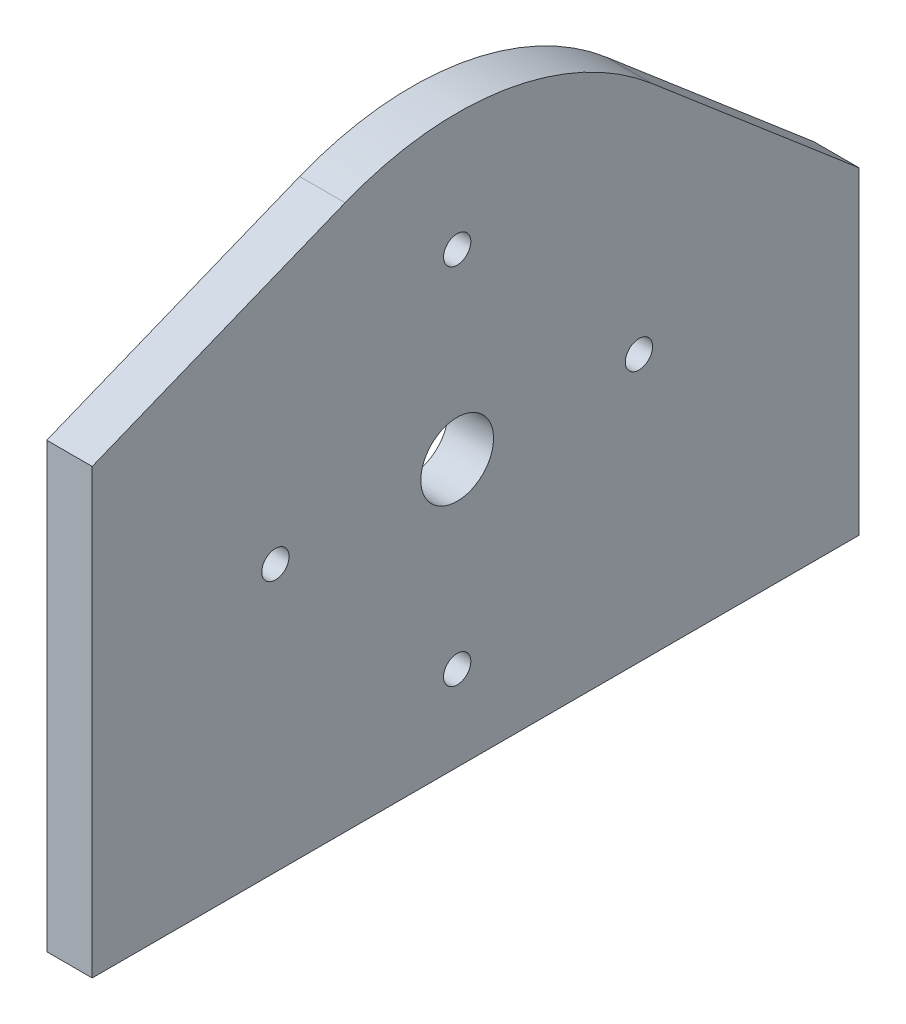
ISO-10303-21;
HEADER;
FILE_DESCRIPTION(('STEP AP214'),'2;1');
FILE_NAME('part.step','',(''),(''),'','','');
FILE_SCHEMA(('AUTOMOTIVE_DESIGN { 1 0 10303 214 1 1 1 1 }'));
ENDSEC;
DATA;
#1=APPLICATION_CONTEXT('core data for automotive mechanical design processes');
#2=APPLICATION_PROTOCOL_DEFINITION('international standard','automotive_design',2000,#1);
#3=PRODUCT_CONTEXT('',#1,'mechanical');
#4=PRODUCT('Part','Part','',(#3));
#5=PRODUCT_RELATED_PRODUCT_CATEGORY('part','',(#4));
#6=PRODUCT_DEFINITION_FORMATION('','',#4);
#7=PRODUCT_DEFINITION_CONTEXT('part definition',#1,'design');
#8=PRODUCT_DEFINITION('design','',#6,#7);
#9=PRODUCT_DEFINITION_SHAPE('','',#8);
#10=(LENGTH_UNIT() NAMED_UNIT(*) SI_UNIT(.MILLI.,.METRE.));
#11=(NAMED_UNIT(*) PLANE_ANGLE_UNIT() SI_UNIT($,.RADIAN.));
#12=(NAMED_UNIT(*) SI_UNIT($,.STERADIAN.) SOLID_ANGLE_UNIT());
#13=UNCERTAINTY_MEASURE_WITH_UNIT(LENGTH_MEASURE(1.E-05),#10,'distance_accuracy_value','');
#14=(GEOMETRIC_REPRESENTATION_CONTEXT(3) GLOBAL_UNCERTAINTY_ASSIGNED_CONTEXT((#13)) GLOBAL_UNIT_ASSIGNED_CONTEXT((#10,
#11,#12)) REPRESENTATION_CONTEXT('',''));
#15=CARTESIAN_POINT('',(0.,0.,0.));
#16=DIRECTION('',(0.,0.,1.));
#17=DIRECTION('',(1.,0.,0.));
#18=AXIS2_PLACEMENT_3D('',#15,#16,#17);
#19=CARTESIAN_POINT('',(5.,81.,0.));
#20=DIRECTION('',(-1.,0.,0.));
#21=DIRECTION('',(0.,0.,-1.));
#22=AXIS2_PLACEMENT_3D('',#19,#20,#21);
#23=CYLINDRICAL_SURFACE('',#22,33.);
#24=CARTESIAN_POINT('',(0.,81.,0.));
#25=DIRECTION('',(-1.,0.,0.));
#26=DIRECTION('',(0.,0.,1.));
#27=AXIS2_PLACEMENT_3D('',#24,#25,#26);
#28=CIRCLE('',#27,33.);
#29=CARTESIAN_POINT('',(0.,111.608123513055,12.3346169380967));
#30=VERTEX_POINT('',#29);
#31=CARTESIAN_POINT('',(0.,106.111358555441,-21.4107372946394));
#32=VERTEX_POINT('',#31);
#33=EDGE_CURVE('E122',#30,#32,#28,.T.);
#34=ORIENTED_EDGE('',*,*,#33,.F.);
#35=DIRECTION('',(-1.,0.,0.));
#36=VECTOR('',#35,1.);
#37=CARTESIAN_POINT('',(5.,111.608123513055,12.3346169380967));
#38=LINE('',#37,#36);
#39=CARTESIAN_POINT('',(5.,111.608123513055,12.3346169380967));
#40=VERTEX_POINT('',#39);
#41=EDGE_CURVE('E121',#40,#30,#38,.T.);
#42=ORIENTED_EDGE('',*,*,#41,.F.);
#43=CARTESIAN_POINT('',(5.,81.,0.));
#44=DIRECTION('',(-1.,0.,0.));
#45=DIRECTION('',(0.,0.,1.));
#46=AXIS2_PLACEMENT_3D('',#43,#44,#45);
#47=CIRCLE('',#46,33.);
#48=CARTESIAN_POINT('',(5.,106.111358555441,-21.4107372946394));
#49=VERTEX_POINT('',#48);
#50=EDGE_CURVE('E135',#40,#49,#47,.T.);
#51=ORIENTED_EDGE('',*,*,#50,.T.);
#52=DIRECTION('',(-1.,0.,0.));
#53=VECTOR('',#52,1.);
#54=CARTESIAN_POINT('',(5.,106.111358555441,-21.4107372946394));
#55=LINE('',#54,#53);
#56=EDGE_CURVE('E11',#49,#32,#55,.T.);
#57=ORIENTED_EDGE('',*,*,#56,.T.);
#58=EDGE_LOOP('',(#34,#42,#51,#57));
#59=FACE_BOUND('',#58,.T.);
#60=ADVANCED_FACE('F39',(#59),#23,.T.);
#61=CARTESIAN_POINT('',(5.,86.6470519239509,-44.2392450723134));
#62=DIRECTION('',(0.,-0.760950259255798,0.64881022104968));
#63=DIRECTION('',(0.,0.64881022104968,0.760950259255798));
#64=AXIS2_PLACEMENT_3D('',#61,#62,#63);
#65=PLANE('',#64);
#66=DIRECTION('',(0.,-0.64881022104968,-0.760950259255798));
#67=VECTOR('',#66,1.);
#68=CARTESIAN_POINT('',(0.,86.6470519239509,-44.2392450723134));
#69=LINE('',#68,#67);
#70=CARTESIAN_POINT('',(0.,86.6470519239509,-44.2392450723134));
#71=VERTEX_POINT('',#70);
#72=EDGE_CURVE('E124',#32,#71,#69,.T.);
#73=ORIENTED_EDGE('',*,*,#72,.F.);
#74=ORIENTED_EDGE('',*,*,#56,.F.);
#75=DIRECTION('',(0.,-0.64881022104968,-0.760950259255798));
#76=VECTOR('',#75,1.);
#77=CARTESIAN_POINT('',(5.,86.6470519239509,-44.2392450723134));
#78=LINE('',#77,#76);
#79=CARTESIAN_POINT('',(5.,86.6470519239509,-44.2392450723134));
#80=VERTEX_POINT('',#79);
#81=EDGE_CURVE('E87',#49,#80,#78,.T.);
#82=ORIENTED_EDGE('',*,*,#81,.T.);
#83=DIRECTION('',(-1.,0.,0.));
#84=VECTOR('',#83,1.);
#85=CARTESIAN_POINT('',(5.,86.6470519239509,-44.2392450723134));
#86=LINE('',#85,#84);
#87=EDGE_CURVE('E47',#80,#71,#86,.T.);
#88=ORIENTED_EDGE('',*,*,#87,.T.);
#89=EDGE_LOOP('',(#73,#74,#82,#88));
#90=FACE_BOUND('',#89,.T.);
#91=ADVANCED_FACE('F141',(#90),#65,.F.);
#92=CARTESIAN_POINT('',(5.,86.6470519239509,-44.2392450723134));
#93=DIRECTION('',(0.,0.,1.));
#94=DIRECTION('',(0.,1.,0.));
#95=AXIS2_PLACEMENT_3D('',#92,#93,#94);
#96=PLANE('',#95);
#97=DIRECTION('',(0.,-1.,0.));
#98=VECTOR('',#97,1.);
#99=CARTESIAN_POINT('',(0.,86.6470519239509,-44.2392450723134));
#100=LINE('',#99,#98);
#101=CARTESIAN_POINT('',(0.,51.6470519239509,-44.2392450723133));
#102=VERTEX_POINT('',#101);
#103=EDGE_CURVE('E128',#71,#102,#100,.T.);
#104=ORIENTED_EDGE('',*,*,#103,.F.);
#105=ORIENTED_EDGE('',*,*,#87,.F.);
#106=DIRECTION('',(0.,-1.,0.));
#107=VECTOR('',#106,1.);
#108=CARTESIAN_POINT('',(5.,86.6470519239509,-44.2392450723134));
#109=LINE('',#108,#107);
#110=CARTESIAN_POINT('',(5.,51.6470519239509,-44.2392450723133));
#111=VERTEX_POINT('',#110);
#112=EDGE_CURVE('E115',#80,#111,#109,.T.);
#113=ORIENTED_EDGE('',*,*,#112,.T.);
#114=DIRECTION('',(-1.,0.,0.));
#115=VECTOR('',#114,1.);
#116=CARTESIAN_POINT('',(5.,51.6470519239509,-44.2392450723133));
#117=LINE('',#116,#115);
#118=EDGE_CURVE('E109',#111,#102,#117,.T.);
#119=ORIENTED_EDGE('',*,*,#118,.T.);
#120=EDGE_LOOP('',(#104,#105,#113,#119));
#121=FACE_BOUND('',#120,.T.);
#122=ADVANCED_FACE('F217',(#121),#96,.F.);
#123=CARTESIAN_POINT('',(5.,51.6470519239509,-44.2392450723133));
#124=DIRECTION('',(0.,1.,0.));
#125=DIRECTION('',(0.,0.,-1.));
#126=AXIS2_PLACEMENT_3D('',#123,#124,#125);
#127=PLANE('',#126);
#128=DIRECTION('',(0.,0.,1.));
#129=VECTOR('',#128,1.);
#130=CARTESIAN_POINT('',(0.,51.6470519239509,-44.2392450723133));
#131=LINE('',#130,#129);
#132=CARTESIAN_POINT('',(0.,51.6470519239509,40.1601837681465));
#133=VERTEX_POINT('',#132);
#134=EDGE_CURVE('E131',#102,#133,#131,.T.);
#135=ORIENTED_EDGE('',*,*,#134,.F.);
#136=ORIENTED_EDGE('',*,*,#118,.F.);
#137=DIRECTION('',(0.,0.,1.));
#138=VECTOR('',#137,1.);
#139=CARTESIAN_POINT('',(5.,51.6470519239509,-44.2392450723133));
#140=LINE('',#139,#138);
#141=CARTESIAN_POINT('',(5.,51.6470519239509,40.1601837681465));
#142=VERTEX_POINT('',#141);
#143=EDGE_CURVE('E99',#111,#142,#140,.T.);
#144=ORIENTED_EDGE('',*,*,#143,.T.);
#145=DIRECTION('',(-1.,0.,0.));
#146=VECTOR('',#145,1.);
#147=CARTESIAN_POINT('',(5.,51.6470519239509,40.1601837681465));
#148=LINE('',#147,#146);
#149=EDGE_CURVE('E104',#142,#133,#148,.T.);
#150=ORIENTED_EDGE('',*,*,#149,.T.);
#151=EDGE_LOOP('',(#135,#136,#144,#150));
#152=FACE_BOUND('',#151,.T.);
#153=ADVANCED_FACE('F112',(#152),#127,.F.);
#154=CARTESIAN_POINT('',(5.,51.6470519239509,40.1601837681465));
#155=DIRECTION('',(0.,0.,-1.));
#156=DIRECTION('',(0.,-1.,0.));
#157=AXIS2_PLACEMENT_3D('',#154,#155,#156);
#158=PLANE('',#157);
#159=DIRECTION('',(0.,1.,0.));
#160=VECTOR('',#159,1.);
#161=CARTESIAN_POINT('',(0.,51.6470519239509,40.1601837681465));
#162=LINE('',#161,#160);
#163=CARTESIAN_POINT('',(0.,100.394835387512,40.1601837681464));
#164=VERTEX_POINT('',#163);
#165=EDGE_CURVE('E106',#133,#164,#162,.T.);
#166=ORIENTED_EDGE('',*,*,#165,.F.);
#167=ORIENTED_EDGE('',*,*,#149,.F.);
#168=DIRECTION('',(0.,1.,0.));
#169=VECTOR('',#168,1.);
#170=CARTESIAN_POINT('',(5.,51.6470519239509,40.1601837681465));
#171=LINE('',#170,#169);
#172=CARTESIAN_POINT('',(5.,100.394835387512,40.1601837681464));
#173=VERTEX_POINT('',#172);
#174=EDGE_CURVE('E95',#142,#173,#171,.T.);
#175=ORIENTED_EDGE('',*,*,#174,.T.);
#176=DIRECTION('',(-1.,0.,0.));
#177=VECTOR('',#176,1.);
#178=CARTESIAN_POINT('',(5.,100.394835387512,40.1601837681464));
#179=LINE('',#178,#177);
#180=EDGE_CURVE('E110',#173,#164,#179,.T.);
#181=ORIENTED_EDGE('',*,*,#180,.T.);
#182=EDGE_LOOP('',(#166,#167,#175,#181));
#183=FACE_BOUND('',#182,.T.);
#184=ADVANCED_FACE('F105',(#183),#158,.F.);
#185=CARTESIAN_POINT('',(5.,100.394835387512,40.1601837681464));
#186=DIRECTION('',(0.,-0.927518894334992,-0.37377627085142));
#187=DIRECTION('',(0.,-0.37377627085142,0.927518894334992));
#188=AXIS2_PLACEMENT_3D('',#185,#186,#187);
#189=PLANE('',#188);
#190=DIRECTION('',(0.,0.37377627085142,-0.927518894334992));
#191=VECTOR('',#190,1.);
#192=CARTESIAN_POINT('',(0.,100.394835387512,40.1601837681464));
#193=LINE('',#192,#191);
#194=EDGE_CURVE('E75',#164,#30,#193,.T.);
#195=ORIENTED_EDGE('',*,*,#194,.F.);
#196=ORIENTED_EDGE('',*,*,#180,.F.);
#197=DIRECTION('',(0.,0.37377627085142,-0.927518894334992));
#198=VECTOR('',#197,1.);
#199=CARTESIAN_POINT('',(5.,100.394835387512,40.1601837681464));
#200=LINE('',#199,#198);
#201=EDGE_CURVE('E55',#173,#40,#200,.T.);
#202=ORIENTED_EDGE('',*,*,#201,.T.);
#203=ORIENTED_EDGE('',*,*,#41,.T.);
#204=EDGE_LOOP('',(#195,#196,#202,#203));
#205=FACE_BOUND('',#204,.T.);
#206=ADVANCED_FACE('F227',(#205),#189,.F.);
#207=CARTESIAN_POINT('',(5.,81.,0.));
#208=DIRECTION('',(1.,0.,0.));
#209=DIRECTION('',(0.,0.,1.));
#210=AXIS2_PLACEMENT_3D('',#207,#208,#209);
#211=PLANE('',#210);
#212=CARTESIAN_POINT('',(5.,81.,0.));
#213=DIRECTION('',(-1.,0.,0.));
#214=DIRECTION('',(0.,0.,1.));
#215=AXIS2_PLACEMENT_3D('',#212,#213,#214);
#216=CIRCLE('',#215,4.);
#217=CARTESIAN_POINT('',(5.,81.,4.));
#218=VERTEX_POINT('',#217);
#219=EDGE_CURVE('E171',#218,#218,#216,.T.);
#220=ORIENTED_EDGE('',*,*,#219,.T.);
#221=EDGE_LOOP('',(#220));
#222=FACE_BOUND('',#221,.T.);
#223=CARTESIAN_POINT('',(5.,81.,-20.));
#224=DIRECTION('',(-1.,0.,0.));
#225=DIRECTION('',(0.,0.,1.));
#226=AXIS2_PLACEMENT_3D('',#223,#224,#225);
#227=CIRCLE('',#226,1.5);
#228=CARTESIAN_POINT('',(5.,81.,-18.5));
#229=VERTEX_POINT('',#228);
#230=EDGE_CURVE('E165',#229,#229,#227,.T.);
#231=ORIENTED_EDGE('',*,*,#230,.T.);
#232=EDGE_LOOP('',(#231));
#233=FACE_BOUND('',#232,.T.);
#234=CARTESIAN_POINT('',(5.,81.,20.));
#235=DIRECTION('',(-1.,0.,0.));
#236=DIRECTION('',(0.,0.,1.));
#237=AXIS2_PLACEMENT_3D('',#234,#235,#236);
#238=CIRCLE('',#237,1.5);
#239=CARTESIAN_POINT('',(5.,81.,21.5));
#240=VERTEX_POINT('',#239);
#241=EDGE_CURVE('E159',#240,#240,#238,.T.);
#242=ORIENTED_EDGE('',*,*,#241,.T.);
#243=EDGE_LOOP('',(#242));
#244=FACE_BOUND('',#243,.T.);
#245=CARTESIAN_POINT('',(5.,61.,0.));
#246=DIRECTION('',(-1.,0.,0.));
#247=DIRECTION('',(0.,0.,1.));
#248=AXIS2_PLACEMENT_3D('',#245,#246,#247);
#249=CIRCLE('',#248,1.5);
#250=CARTESIAN_POINT('',(5.,61.,1.50000000000001));
#251=VERTEX_POINT('',#250);
#252=EDGE_CURVE('E153',#251,#251,#249,.T.);
#253=ORIENTED_EDGE('',*,*,#252,.T.);
#254=EDGE_LOOP('',(#253));
#255=FACE_BOUND('',#254,.T.);
#256=CARTESIAN_POINT('',(5.,101.,0.));
#257=DIRECTION('',(-1.,0.,0.));
#258=DIRECTION('',(0.,0.,1.));
#259=AXIS2_PLACEMENT_3D('',#256,#257,#258);
#260=CIRCLE('',#259,1.5);
#261=CARTESIAN_POINT('',(5.,101.,1.5));
#262=VERTEX_POINT('',#261);
#263=EDGE_CURVE('E125',#262,#262,#260,.T.);
#264=ORIENTED_EDGE('',*,*,#263,.T.);
#265=EDGE_LOOP('',(#264));
#266=FACE_BOUND('',#265,.T.);
#267=ORIENTED_EDGE('',*,*,#50,.F.);
#268=ORIENTED_EDGE('',*,*,#201,.F.);
#269=ORIENTED_EDGE('',*,*,#174,.F.);
#270=ORIENTED_EDGE('',*,*,#143,.F.);
#271=ORIENTED_EDGE('',*,*,#112,.F.);
#272=ORIENTED_EDGE('',*,*,#81,.F.);
#273=EDGE_LOOP('',(#267,#268,#269,#270,#271,#272));
#274=FACE_BOUND('',#273,.T.);
#275=ADVANCED_FACE('F97',(#222,#233,#244,#255,#266,#274),#211,.T.);
#276=CARTESIAN_POINT('',(0.,81.,0.));
#277=DIRECTION('',(1.,0.,0.));
#278=DIRECTION('',(0.,0.,1.));
#279=AXIS2_PLACEMENT_3D('',#276,#277,#278);
#280=PLANE('',#279);
#281=CARTESIAN_POINT('',(0.,81.,0.));
#282=DIRECTION('',(-1.,0.,0.));
#283=DIRECTION('',(0.,0.,1.));
#284=AXIS2_PLACEMENT_3D('',#281,#282,#283);
#285=CIRCLE('',#284,4.);
#286=CARTESIAN_POINT('',(0.,81.,4.));
#287=VERTEX_POINT('',#286);
#288=EDGE_CURVE('E174',#287,#287,#285,.T.);
#289=ORIENTED_EDGE('',*,*,#288,.F.);
#290=EDGE_LOOP('',(#289));
#291=FACE_BOUND('',#290,.T.);
#292=CARTESIAN_POINT('',(0.,81.,-20.));
#293=DIRECTION('',(-1.,0.,0.));
#294=DIRECTION('',(0.,0.,1.));
#295=AXIS2_PLACEMENT_3D('',#292,#293,#294);
#296=CIRCLE('',#295,1.5);
#297=CARTESIAN_POINT('',(0.,81.,-18.5));
#298=VERTEX_POINT('',#297);
#299=EDGE_CURVE('E168',#298,#298,#296,.T.);
#300=ORIENTED_EDGE('',*,*,#299,.F.);
#301=EDGE_LOOP('',(#300));
#302=FACE_BOUND('',#301,.T.);
#303=CARTESIAN_POINT('',(0.,81.,20.));
#304=DIRECTION('',(-1.,0.,0.));
#305=DIRECTION('',(0.,0.,1.));
#306=AXIS2_PLACEMENT_3D('',#303,#304,#305);
#307=CIRCLE('',#306,1.5);
#308=CARTESIAN_POINT('',(0.,81.,21.5));
#309=VERTEX_POINT('',#308);
#310=EDGE_CURVE('E162',#309,#309,#307,.T.);
#311=ORIENTED_EDGE('',*,*,#310,.F.);
#312=EDGE_LOOP('',(#311));
#313=FACE_BOUND('',#312,.T.);
#314=CARTESIAN_POINT('',(0.,61.,0.));
#315=DIRECTION('',(-1.,0.,0.));
#316=DIRECTION('',(0.,0.,1.));
#317=AXIS2_PLACEMENT_3D('',#314,#315,#316);
#318=CIRCLE('',#317,1.5);
#319=CARTESIAN_POINT('',(0.,61.,1.50000000000001));
#320=VERTEX_POINT('',#319);
#321=EDGE_CURVE('E156',#320,#320,#318,.T.);
#322=ORIENTED_EDGE('',*,*,#321,.F.);
#323=EDGE_LOOP('',(#322));
#324=FACE_BOUND('',#323,.T.);
#325=CARTESIAN_POINT('',(0.,101.,0.));
#326=DIRECTION('',(-1.,0.,0.));
#327=DIRECTION('',(0.,0.,1.));
#328=AXIS2_PLACEMENT_3D('',#325,#326,#327);
#329=CIRCLE('',#328,1.5);
#330=CARTESIAN_POINT('',(0.,101.,1.5));
#331=VERTEX_POINT('',#330);
#332=EDGE_CURVE('E150',#331,#331,#329,.T.);
#333=ORIENTED_EDGE('',*,*,#332,.F.);
#334=EDGE_LOOP('',(#333));
#335=FACE_BOUND('',#334,.T.);
#336=ORIENTED_EDGE('',*,*,#33,.T.);
#337=ORIENTED_EDGE('',*,*,#72,.T.);
#338=ORIENTED_EDGE('',*,*,#103,.T.);
#339=ORIENTED_EDGE('',*,*,#134,.T.);
#340=ORIENTED_EDGE('',*,*,#165,.T.);
#341=ORIENTED_EDGE('',*,*,#194,.T.);
#342=EDGE_LOOP('',(#336,#337,#338,#339,#340,#341));
#343=FACE_BOUND('',#342,.T.);
#344=ADVANCED_FACE('F143',(#291,#302,#313,#324,#335,#343),#280,.F.);
#345=CARTESIAN_POINT('',(5.,101.,0.));
#346=DIRECTION('',(-1.,0.,0.));
#347=DIRECTION('',(0.,0.,-1.));
#348=AXIS2_PLACEMENT_3D('',#345,#346,#347);
#349=CYLINDRICAL_SURFACE('',#348,1.5);
#350=ORIENTED_EDGE('',*,*,#263,.F.);
#351=EDGE_LOOP('',(#350));
#352=FACE_BOUND('',#351,.T.);
#353=ORIENTED_EDGE('',*,*,#332,.T.);
#354=EDGE_LOOP('',(#353));
#355=FACE_BOUND('',#354,.T.);
#356=ADVANCED_FACE('F191',(#352,#355),#349,.F.);
#357=CARTESIAN_POINT('',(5.,61.,0.));
#358=DIRECTION('',(-1.,0.,0.));
#359=DIRECTION('',(0.,0.,-1.));
#360=AXIS2_PLACEMENT_3D('',#357,#358,#359);
#361=CYLINDRICAL_SURFACE('',#360,1.5);
#362=ORIENTED_EDGE('',*,*,#252,.F.);
#363=EDGE_LOOP('',(#362));
#364=FACE_BOUND('',#363,.T.);
#365=ORIENTED_EDGE('',*,*,#321,.T.);
#366=EDGE_LOOP('',(#365));
#367=FACE_BOUND('',#366,.T.);
#368=ADVANCED_FACE('F202',(#364,#367),#361,.F.);
#369=CARTESIAN_POINT('',(5.,81.,20.));
#370=DIRECTION('',(-1.,0.,0.));
#371=DIRECTION('',(0.,0.,-1.));
#372=AXIS2_PLACEMENT_3D('',#369,#370,#371);
#373=CYLINDRICAL_SURFACE('',#372,1.5);
#374=ORIENTED_EDGE('',*,*,#241,.F.);
#375=EDGE_LOOP('',(#374));
#376=FACE_BOUND('',#375,.T.);
#377=ORIENTED_EDGE('',*,*,#310,.T.);
#378=EDGE_LOOP('',(#377));
#379=FACE_BOUND('',#378,.T.);
#380=ADVANCED_FACE('F208',(#376,#379),#373,.F.);
#381=CARTESIAN_POINT('',(5.,81.,-20.));
#382=DIRECTION('',(-1.,0.,0.));
#383=DIRECTION('',(0.,0.,-1.));
#384=AXIS2_PLACEMENT_3D('',#381,#382,#383);
#385=CYLINDRICAL_SURFACE('',#384,1.5);
#386=ORIENTED_EDGE('',*,*,#230,.F.);
#387=EDGE_LOOP('',(#386));
#388=FACE_BOUND('',#387,.T.);
#389=ORIENTED_EDGE('',*,*,#299,.T.);
#390=EDGE_LOOP('',(#389));
#391=FACE_BOUND('',#390,.T.);
#392=ADVANCED_FACE('F185',(#388,#391),#385,.F.);
#393=CARTESIAN_POINT('',(5.,81.,0.));
#394=DIRECTION('',(-1.,0.,0.));
#395=DIRECTION('',(0.,0.,-1.));
#396=AXIS2_PLACEMENT_3D('',#393,#394,#395);
#397=CYLINDRICAL_SURFACE('',#396,4.);
#398=ORIENTED_EDGE('',*,*,#219,.F.);
#399=EDGE_LOOP('',(#398));
#400=FACE_BOUND('',#399,.T.);
#401=ORIENTED_EDGE('',*,*,#288,.T.);
#402=EDGE_LOOP('',(#401));
#403=FACE_BOUND('',#402,.T.);
#404=ADVANCED_FACE('F182',(#400,#403),#397,.F.);
#405=CLOSED_SHELL('',(#60,#91,#122,#153,#184,#206,#275,#344,#356,#368,#380,#392,#404));
#406=MANIFOLD_SOLID_BREP('B2',#405);
#407=ADVANCED_BREP_SHAPE_REPRESENTATION('',(#18,#406),#14);
#408=SHAPE_DEFINITION_REPRESENTATION(#9,#407);
ENDSEC;
END-ISO-10303-21;
